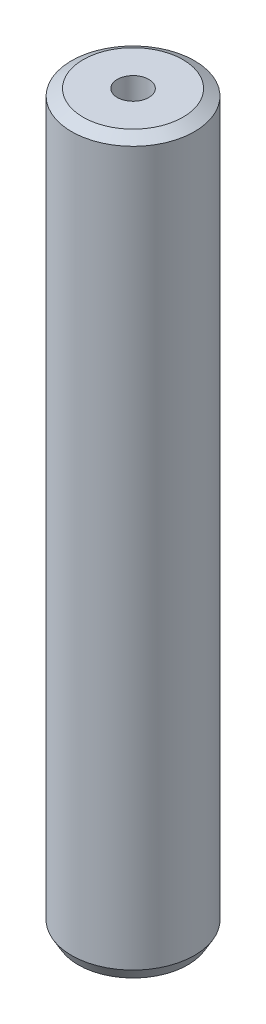
ISO-10303-21;
HEADER;
FILE_DESCRIPTION(('STEP AP214'),'2;1');
FILE_NAME('part.step','',(''),(''),'','','');
FILE_SCHEMA(('AUTOMOTIVE_DESIGN { 1 0 10303 214 1 1 1 1 }'));
ENDSEC;
DATA;
#1=APPLICATION_CONTEXT('core data for automotive mechanical design processes');
#2=APPLICATION_PROTOCOL_DEFINITION('international standard','automotive_design',2000,#1);
#3=PRODUCT_CONTEXT('',#1,'mechanical');
#4=PRODUCT('Part','Part','',(#3));
#5=PRODUCT_RELATED_PRODUCT_CATEGORY('part','',(#4));
#6=PRODUCT_DEFINITION_FORMATION('','',#4);
#7=PRODUCT_DEFINITION_CONTEXT('part definition',#1,'design');
#8=PRODUCT_DEFINITION('design','',#6,#7);
#9=PRODUCT_DEFINITION_SHAPE('','',#8);
#10=(LENGTH_UNIT() NAMED_UNIT(*) SI_UNIT(.MILLI.,.METRE.));
#11=(NAMED_UNIT(*) PLANE_ANGLE_UNIT() SI_UNIT($,.RADIAN.));
#12=(NAMED_UNIT(*) SI_UNIT($,.STERADIAN.) SOLID_ANGLE_UNIT());
#13=UNCERTAINTY_MEASURE_WITH_UNIT(LENGTH_MEASURE(1.E-05),#10,'distance_accuracy_value','');
#14=(GEOMETRIC_REPRESENTATION_CONTEXT(3) GLOBAL_UNCERTAINTY_ASSIGNED_CONTEXT((#13)) GLOBAL_UNIT_ASSIGNED_CONTEXT((#10,
#11,#12)) REPRESENTATION_CONTEXT('',''));
#15=CARTESIAN_POINT('',(0.,0.,0.));
#16=DIRECTION('',(0.,0.,1.));
#17=DIRECTION('',(1.,0.,0.));
#18=AXIS2_PLACEMENT_3D('',#15,#16,#17);
#19=CARTESIAN_POINT('',(0.,89.2455358347797,0.));
#20=DIRECTION('',(0.,-1.,0.));
#21=DIRECTION('',(0.,0.,-1.));
#22=AXIS2_PLACEMENT_3D('',#19,#20,#21);
#23=CYLINDRICAL_SURFACE('',#22,7.5);
#24=CARTESIAN_POINT('',(0.,88.4298860477875,0.));
#25=DIRECTION('',(0.,1.,0.));
#26=DIRECTION('',(0.,0.,1.));
#27=AXIS2_PLACEMENT_3D('',#24,#25,#26);
#28=CIRCLE('',#27,7.5);
#29=CARTESIAN_POINT('',(0.,88.4298860477875,-7.5));
#30=VERTEX_POINT('',#29);
#31=EDGE_CURVE('E50',#30,#30,#28,.F.);
#32=CARTESIAN_POINT('',(0.,1.41274687225344,0.));
#33=DIRECTION('',(0.,1.,0.));
#34=DIRECTION('',(0.,0.,1.));
#35=AXIS2_PLACEMENT_3D('',#32,#33,#34);
#36=CIRCLE('',#35,7.5);
#37=CARTESIAN_POINT('',(0.,1.41274687225344,-7.5));
#38=VERTEX_POINT('',#37);
#39=EDGE_CURVE('E51',#38,#38,#36,.T.);
#40=CARTESIAN_POINT('',(0.,88.4298860477875,-7.5));
#41=CARTESIAN_POINT('',(0.,87.523457514709,-7.5));
#42=CARTESIAN_POINT('',(0.,86.6170289816305,-7.5));
#43=CARTESIAN_POINT('',(0.,84.8041719154736,-7.5));
#44=CARTESIAN_POINT('',(0.,83.8977433823951,-7.5));
#45=CARTESIAN_POINT('',(0.,82.0848863162381,-7.5));
#46=CARTESIAN_POINT('',(0.,81.1784577831597,-7.5));
#47=CARTESIAN_POINT('',(0.,79.3656007170027,-7.5));
#48=CARTESIAN_POINT('',(0.,78.4591721839242,-7.5));
#49=CARTESIAN_POINT('',(0.,76.6463151177672,-7.5));
#50=CARTESIAN_POINT('',(0.,75.7398865846888,-7.5));
#51=CARTESIAN_POINT('',(0.,73.9270295185318,-7.5));
#52=CARTESIAN_POINT('',(0.,73.0206009854533,-7.5));
#53=CARTESIAN_POINT('',(0.,71.2077439192964,-7.5));
#54=CARTESIAN_POINT('',(0.,70.3013153862179,-7.5));
#55=CARTESIAN_POINT('',(0.,68.4884583200609,-7.5));
#56=CARTESIAN_POINT('',(0.,67.5820297869825,-7.5));
#57=CARTESIAN_POINT('',(0.,65.7691727208255,-7.5));
#58=CARTESIAN_POINT('',(0.,64.862744187747,-7.5));
#59=CARTESIAN_POINT('',(0.,63.0498871215901,-7.5));
#60=CARTESIAN_POINT('',(0.,62.1434585885116,-7.5));
#61=CARTESIAN_POINT('',(0.,60.3306015223546,-7.5));
#62=CARTESIAN_POINT('',(0.,59.4241729892761,-7.5));
#63=CARTESIAN_POINT('',(0.,57.6113159231192,-7.5));
#64=CARTESIAN_POINT('',(0.,56.7048873900407,-7.5));
#65=CARTESIAN_POINT('',(0.,54.8920303238837,-7.5));
#66=CARTESIAN_POINT('',(0.,53.9856017908053,-7.5));
#67=CARTESIAN_POINT('',(0.,52.1727447246483,-7.5));
#68=CARTESIAN_POINT('',(0.,51.2663161915698,-7.5));
#69=CARTESIAN_POINT('',(0.,49.4534591254129,-7.5));
#70=CARTESIAN_POINT('',(0.,48.5470305923344,-7.5));
#71=CARTESIAN_POINT('',(0.,46.7341735261774,-7.5));
#72=CARTESIAN_POINT('',(0.,45.8277449930989,-7.5));
#73=CARTESIAN_POINT('',(0.,44.014887926942,-7.5));
#74=CARTESIAN_POINT('',(0.,43.1084593938635,-7.5));
#75=CARTESIAN_POINT('',(0.,41.2956023277065,-7.5));
#76=CARTESIAN_POINT('',(0.,40.3891737946281,-7.5));
#77=CARTESIAN_POINT('',(0.,38.5763167284711,-7.5));
#78=CARTESIAN_POINT('',(0.,37.6698881953926,-7.5));
#79=CARTESIAN_POINT('',(0.,35.8570311292357,-7.5));
#80=CARTESIAN_POINT('',(0.,34.9506025961572,-7.5));
#81=CARTESIAN_POINT('',(0.,33.1377455300002,-7.5));
#82=CARTESIAN_POINT('',(0.,32.2313169969217,-7.5));
#83=CARTESIAN_POINT('',(0.,30.4184599307648,-7.5));
#84=CARTESIAN_POINT('',(0.,29.5120313976863,-7.5));
#85=CARTESIAN_POINT('',(0.,27.6991743315294,-7.5));
#86=CARTESIAN_POINT('',(0.,26.7927457984509,-7.5));
#87=CARTESIAN_POINT('',(0.,24.9798887322939,-7.5));
#88=CARTESIAN_POINT('',(0.,24.0734601992154,-7.5));
#89=CARTESIAN_POINT('',(0.,22.2606031330585,-7.5));
#90=CARTESIAN_POINT('',(0.,21.35417459998,-7.5));
#91=CARTESIAN_POINT('',(0.,19.541317533823,-7.5));
#92=CARTESIAN_POINT('',(0.,18.6348890007446,-7.5));
#93=CARTESIAN_POINT('',(0.,16.8220319345876,-7.5));
#94=CARTESIAN_POINT('',(0.,15.9156034015091,-7.5));
#95=CARTESIAN_POINT('',(0.,14.1027463353522,-7.5));
#96=CARTESIAN_POINT('',(0.,13.1963178022737,-7.5));
#97=CARTESIAN_POINT('',(0.,11.3834607361167,-7.5));
#98=CARTESIAN_POINT('',(0.,10.4770322030383,-7.5));
#99=CARTESIAN_POINT('',(0.,8.66417513688129,-7.5));
#100=CARTESIAN_POINT('',(0.,7.75774660380281,-7.5));
#101=CARTESIAN_POINT('',(0.,5.94488953764585,-7.5));
#102=CARTESIAN_POINT('',(0.,5.03846100456737,-7.5));
#103=CARTESIAN_POINT('',(0.,3.22560393841041,-7.5));
#104=CARTESIAN_POINT('',(0.,2.31917540533193,-7.5));
#105=CARTESIAN_POINT('',(0.,1.41274687225344,-7.5));
#106=B_SPLINE_CURVE_WITH_KNOTS('',3,(#40,#41,#42,#43,#44,#45,#46,#47,#48,#49,#50,#51,#52,#53,
#54,#55,#56,#57,#58,#59,#60,#61,#62,#63,#64,#65,#66,#67,#68,#69,#70,#71,#72,#73,#74,#75,#76,#77,
#78,#79,#80,#81,#82,#83,#84,#85,#86,#87,#88,#89,#90,#91,#92,#93,#94,#95,#96,#97,#98,#99,#100,
#101,#102,#103,#104,#105),.UNSPECIFIED.,.F.,.F.,(4,2,2,2,2,2,2,2,2,2,2,2,2,2,2,2,2,2,2,2,2,2,2,
2,2,2,2,2,2,2,2,2,4),(0.,2.71928559923544,5.43857119847088,8.15785679770632,10.8771423969418,
13.5964279961772,16.3157135954126,19.0349991946481,21.7542847938835,24.473570393119,
27.1928559923544,29.9121415915898,32.6314271908253,35.3507127900607,38.0699983892961,
40.7892839885316,43.508569587767,46.2278551870025,48.9471407862379,51.6664263854733,
54.3857119847088,57.1049975839442,59.8242831831797,62.5435687824151,65.2628543816505,
67.982139980886,70.7014255801214,73.4207111793569,76.1399967785923,78.8592823778277,
81.5785679770632,84.2978535762986,87.0171391755341),.UNSPECIFIED.);
#107=EDGE_CURVE('BSEAM39',#30,#38,#106,.T.);
#108=ORIENTED_EDGE('',*,*,#31,.T.);
#109=ORIENTED_EDGE('',*,*,#39,.T.);
#110=ORIENTED_EDGE('',*,*,#107,.T.);
#111=ORIENTED_EDGE('',*,*,#107,.F.);
#112=EDGE_LOOP('',(#108,#110,#109,#111));
#113=FACE_BOUND('',#112,.T.);
#114=ADVANCED_FACE('F39',(#113),#23,.T.);
#115=CARTESIAN_POINT('',(0.,89.2455358347797,0.));
#116=DIRECTION('',(0.,1.,0.));
#117=DIRECTION('',(0.,0.,1.));
#118=AXIS2_PLACEMENT_3D('',#115,#116,#117);
#119=PLANE('',#118);
#120=CARTESIAN_POINT('',(0.,89.2455358347797,0.));
#121=DIRECTION('',(0.,1.,0.));
#122=DIRECTION('',(0.,0.,1.));
#123=AXIS2_PLACEMENT_3D('',#120,#121,#122);
#124=CIRCLE('',#123,6.08725312774681);
#125=CARTESIAN_POINT('',(0.,89.2455358347797,6.08725312774681));
#126=VERTEX_POINT('',#125);
#127=EDGE_CURVE('E54',#126,#126,#124,.T.);
#128=ORIENTED_EDGE('',*,*,#127,.T.);
#129=EDGE_LOOP('',(#128));
#130=FACE_BOUND('',#129,.T.);
#131=CARTESIAN_POINT('',(0.,89.2455358347797,0.));
#132=DIRECTION('',(0.,1.,0.));
#133=DIRECTION('',(0.,0.,1.));
#134=AXIS2_PLACEMENT_3D('',#131,#132,#133);
#135=CIRCLE('',#134,1.92141821893141);
#136=CARTESIAN_POINT('',(0.,89.2455358347797,-1.92141821893141));
#137=VERTEX_POINT('',#136);
#138=EDGE_CURVE('E58',#137,#137,#135,.T.);
#139=ORIENTED_EDGE('',*,*,#138,.F.);
#140=EDGE_LOOP('',(#139));
#141=FACE_BOUND('',#140,.T.);
#142=ADVANCED_FACE('F69',(#130,#141),#119,.T.);
#143=CARTESIAN_POINT('',(0.,0.,0.));
#144=DIRECTION('',(0.,1.,0.));
#145=DIRECTION('',(0.,0.,1.));
#146=AXIS2_PLACEMENT_3D('',#143,#144,#145);
#147=PLANE('',#146);
#148=CARTESIAN_POINT('',(0.,0.,0.));
#149=DIRECTION('',(0.,1.,0.));
#150=DIRECTION('',(0.,0.,1.));
#151=AXIS2_PLACEMENT_3D('',#148,#149,#150);
#152=CIRCLE('',#151,6.68435021300768);
#153=CARTESIAN_POINT('',(0.,0.,6.68435021300768));
#154=VERTEX_POINT('',#153);
#155=EDGE_CURVE('E10',#154,#154,#152,.F.);
#156=ORIENTED_EDGE('',*,*,#155,.T.);
#157=EDGE_LOOP('',(#156));
#158=FACE_BOUND('',#157,.T.);
#159=CARTESIAN_POINT('',(0.,0.,0.));
#160=DIRECTION('',(0.,1.,0.));
#161=DIRECTION('',(0.,0.,1.));
#162=AXIS2_PLACEMENT_3D('',#159,#160,#161);
#163=CIRCLE('',#162,1.92141821893141);
#164=CARTESIAN_POINT('',(0.,0.,-1.92141821893141));
#165=VERTEX_POINT('',#164);
#166=EDGE_CURVE('E63',#165,#165,#163,.T.);
#167=ORIENTED_EDGE('',*,*,#166,.T.);
#168=EDGE_LOOP('',(#167));
#169=FACE_BOUND('',#168,.T.);
#170=ADVANCED_FACE('F75',(#158,#169),#147,.F.);
#171=CARTESIAN_POINT('',(0.,89.2455358347797,0.));
#172=DIRECTION('',(0.,-1.,0.));
#173=DIRECTION('',(0.,0.,-1.));
#174=AXIS2_PLACEMENT_3D('',#171,#172,#173);
#175=CYLINDRICAL_SURFACE('',#174,1.92141821893141);
#176=CARTESIAN_POINT('',(0.,89.2455358347797,-1.92141821893141));
#177=CARTESIAN_POINT('',(0.,88.3158948365007,-1.92141821893141));
#178=CARTESIAN_POINT('',(0.,87.3862538382217,-1.92141821893141));
#179=CARTESIAN_POINT('',(0.,85.5269718416638,-1.92141821893141));
#180=CARTESIAN_POINT('',(0.,84.5973308433849,-1.92141821893141));
#181=CARTESIAN_POINT('',(0.,82.738048846827,-1.92141821893141));
#182=CARTESIAN_POINT('',(0.,81.808407848548,-1.92141821893141));
#183=CARTESIAN_POINT('',(0.,79.9491258519901,-1.92141821893141));
#184=CARTESIAN_POINT('',(0.,79.0194848537112,-1.92141821893141));
#185=CARTESIAN_POINT('',(0.,77.1602028571533,-1.92141821893141));
#186=CARTESIAN_POINT('',(0.,76.2305618588743,-1.92141821893141));
#187=CARTESIAN_POINT('',(0.,74.3712798623164,-1.92141821893141));
#188=CARTESIAN_POINT('',(0.,73.4416388640374,-1.92141821893141));
#189=CARTESIAN_POINT('',(0.,71.5823568674795,-1.92141821893141));
#190=CARTESIAN_POINT('',(0.,70.6527158692006,-1.92141821893141));
#191=CARTESIAN_POINT('',(0.,68.7934338726427,-1.92141821893141));
#192=CARTESIAN_POINT('',(0.,67.8637928743637,-1.92141821893141));
#193=CARTESIAN_POINT('',(0.,66.0045108778058,-1.92141821893141));
#194=CARTESIAN_POINT('',(0.,65.0748698795268,-1.92141821893141));
#195=CARTESIAN_POINT('',(0.,63.2155878829689,-1.92141821893141));
#196=CARTESIAN_POINT('',(0.,62.28594688469,-1.92141821893141));
#197=CARTESIAN_POINT('',(0.,60.4266648881321,-1.92141821893141));
#198=CARTESIAN_POINT('',(0.,59.4970238898531,-1.92141821893141));
#199=CARTESIAN_POINT('',(0.,57.6377418932952,-1.92141821893141));
#200=CARTESIAN_POINT('',(0.,56.7081008950162,-1.92141821893141));
#201=CARTESIAN_POINT('',(0.,54.8488188984583,-1.92141821893141));
#202=CARTESIAN_POINT('',(0.,53.9191779001794,-1.92141821893141));
#203=CARTESIAN_POINT('',(0.,52.0598959036215,-1.92141821893141));
#204=CARTESIAN_POINT('',(0.,51.1302549053425,-1.92141821893141));
#205=CARTESIAN_POINT('',(0.,49.2709729087846,-1.92141821893141));
#206=CARTESIAN_POINT('',(0.,48.3413319105057,-1.92141821893141));
#207=CARTESIAN_POINT('',(0.,46.4820499139477,-1.92141821893141));
#208=CARTESIAN_POINT('',(0.,45.5524089156688,-1.92141821893141));
#209=CARTESIAN_POINT('',(0.,43.6931269191109,-1.92141821893141));
#210=CARTESIAN_POINT('',(0.,42.7634859208319,-1.92141821893141));
#211=CARTESIAN_POINT('',(0.,40.904203924274,-1.92141821893141));
#212=CARTESIAN_POINT('',(0.,39.9745629259951,-1.92141821893141));
#213=CARTESIAN_POINT('',(0.,38.1152809294371,-1.92141821893141));
#214=CARTESIAN_POINT('',(0.,37.1856399311582,-1.92141821893141));
#215=CARTESIAN_POINT('',(0.,35.3263579346003,-1.92141821893141));
#216=CARTESIAN_POINT('',(0.,34.3967169363213,-1.92141821893141));
#217=CARTESIAN_POINT('',(0.,32.5374349397634,-1.92141821893141));
#218=CARTESIAN_POINT('',(0.,31.6077939414845,-1.92141821893141));
#219=CARTESIAN_POINT('',(0.,29.7485119449266,-1.92141821893141));
#220=CARTESIAN_POINT('',(0.,28.8188709466476,-1.92141821893141));
#221=CARTESIAN_POINT('',(0.,26.9595889500897,-1.92141821893141));
#222=CARTESIAN_POINT('',(0.,26.0299479518107,-1.92141821893141));
#223=CARTESIAN_POINT('',(0.,24.1706659552528,-1.92141821893141));
#224=CARTESIAN_POINT('',(0.,23.2410249569739,-1.92141821893141));
#225=CARTESIAN_POINT('',(0.,21.3817429604159,-1.92141821893141));
#226=CARTESIAN_POINT('',(0.,20.452101962137,-1.92141821893141));
#227=CARTESIAN_POINT('',(0.,18.5928199655791,-1.92141821893141));
#228=CARTESIAN_POINT('',(0.,17.6631789673001,-1.92141821893141));
#229=CARTESIAN_POINT('',(0.,15.8038969707422,-1.92141821893141));
#230=CARTESIAN_POINT('',(0.,14.8742559724633,-1.92141821893141));
#231=CARTESIAN_POINT('',(0.,13.0149739759054,-1.92141821893141));
#232=CARTESIAN_POINT('',(0.,12.0853329776264,-1.92141821893141));
#233=CARTESIAN_POINT('',(0.,10.2260509810685,-1.92141821893141));
#234=CARTESIAN_POINT('',(0.,9.29640998278954,-1.92141821893141));
#235=CARTESIAN_POINT('',(0.,7.43712798623163,-1.92141821893141));
#236=CARTESIAN_POINT('',(0.,6.50748698795267,-1.92141821893141));
#237=CARTESIAN_POINT('',(0.,4.64820499139476,-1.92141821893141));
#238=CARTESIAN_POINT('',(0.,3.71856399311581,-1.92141821893141));
#239=CARTESIAN_POINT('',(0.,1.8592819965579,-1.92141821893141));
#240=CARTESIAN_POINT('',(0.,0.92964099827894,-1.92141821893141));
#241=CARTESIAN_POINT('',(0.,0.,-1.92141821893141));
#242=B_SPLINE_CURVE_WITH_KNOTS('',3,(#176,#177,#178,#179,#180,#181,#182,#183,#184,#185,#186,
#187,#188,#189,#190,#191,#192,#193,#194,#195,#196,#197,#198,#199,#200,#201,#202,#203,#204,#205,
#206,#207,#208,#209,#210,#211,#212,#213,#214,#215,#216,#217,#218,#219,#220,#221,#222,#223,#224,
#225,#226,#227,#228,#229,#230,#231,#232,#233,#234,#235,#236,#237,#238,#239,#240,#241),
.UNSPECIFIED.,.F.,.F.,(4,2,2,2,2,2,2,2,2,2,2,2,2,2,2,2,2,2,2,2,2,2,2,2,2,2,2,2,2,2,2,2,4),(0.,
2.78892299483686,5.57784598967372,8.36676898451059,11.1556919793474,13.9446149741843,
16.7335379690212,19.5224609638581,22.3113839586949,25.1003069535318,27.8892299483686,
30.6781529432055,33.4670759380424,36.2559989328792,39.0449219277161,41.833844922553,
44.6227679173898,47.4116909122267,50.2006139070636,52.9895369019004,55.7784598967373,
58.5673828915742,61.356305886411,64.1452288812479,66.9341518760848,69.7230748709216,
72.5119978657585,75.3009208605954,78.0898438554322,80.8787668502691,83.6676898451059,
86.4566128399428,89.2455358347797),.UNSPECIFIED.);
#243=EDGE_CURVE('BSEAM70',#137,#165,#242,.T.);
#244=ORIENTED_EDGE('',*,*,#138,.T.);
#245=ORIENTED_EDGE('',*,*,#166,.F.);
#246=ORIENTED_EDGE('',*,*,#243,.T.);
#247=ORIENTED_EDGE('',*,*,#243,.F.);
#248=EDGE_LOOP('',(#244,#246,#245,#247));
#249=FACE_BOUND('',#248,.T.);
#250=ADVANCED_FACE('F70',(#249),#175,.F.);
#251=CARTESIAN_POINT('',(0.,89.2455358347797,0.));
#252=DIRECTION('',(0.,-1.,0.));
#253=DIRECTION('',(0.,0.,-1.));
#254=AXIS2_PLACEMENT_3D('',#251,#252,#253);
#255=CONICAL_SURFACE('',#254,6.08725312774681,1.0471975511966);
#256=ORIENTED_EDGE('',*,*,#31,.F.);
#257=EDGE_LOOP('',(#256));
#258=FACE_BOUND('',#257,.T.);
#259=ORIENTED_EDGE('',*,*,#127,.F.);
#260=EDGE_LOOP('',(#259));
#261=FACE_BOUND('',#260,.T.);
#262=ADVANCED_FACE('F81',(#258,#261),#255,.T.);
#263=CARTESIAN_POINT('',(0.,1.41274687225343,0.));
#264=DIRECTION('',(0.,1.,0.));
#265=DIRECTION('',(0.,0.,1.));
#266=AXIS2_PLACEMENT_3D('',#263,#264,#265);
#267=CONICAL_SURFACE('',#266,7.5,0.523598775598301);
#268=ORIENTED_EDGE('',*,*,#155,.F.);
#269=EDGE_LOOP('',(#268));
#270=FACE_BOUND('',#269,.T.);
#271=ORIENTED_EDGE('',*,*,#39,.F.);
#272=EDGE_LOOP('',(#271));
#273=FACE_BOUND('',#272,.T.);
#274=ADVANCED_FACE('F45',(#270,#273),#267,.T.);
#275=CLOSED_SHELL('',(#114,#142,#170,#250,#262,#274));
#276=MANIFOLD_SOLID_BREP('B2',#275);
#277=ADVANCED_BREP_SHAPE_REPRESENTATION('',(#18,#276),#14);
#278=SHAPE_DEFINITION_REPRESENTATION(#9,#277);
ENDSEC;
END-ISO-10303-21;
